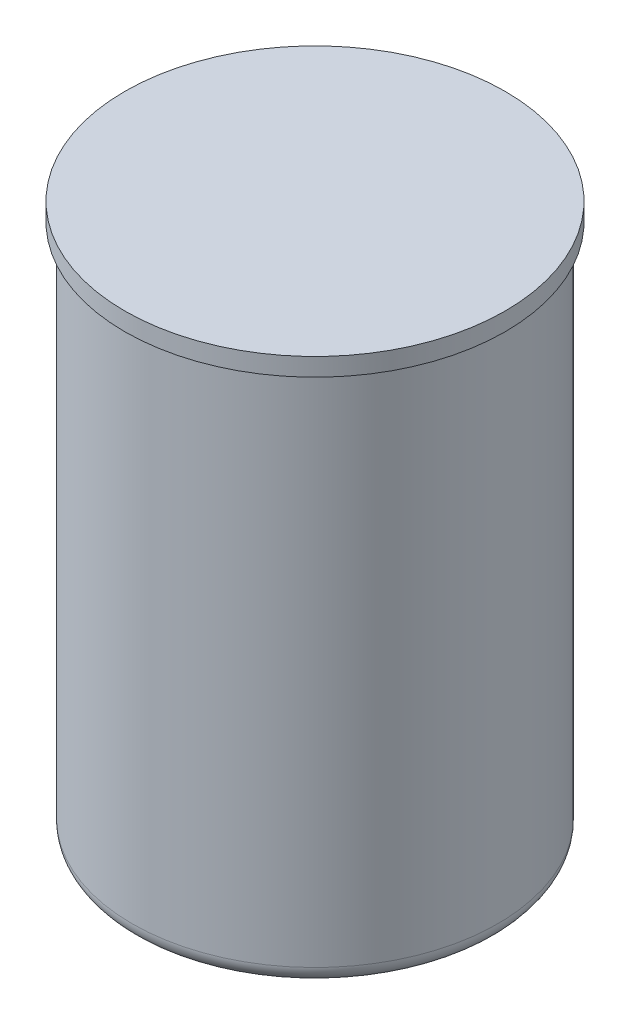
ISO-10303-21;
HEADER;
FILE_DESCRIPTION(('STEP AP214'),'2;1');
FILE_NAME('part.step','',(''),(''),'','','');
FILE_SCHEMA(('AUTOMOTIVE_DESIGN { 1 0 10303 214 1 1 1 1 }'));
ENDSEC;
DATA;
#1=APPLICATION_CONTEXT('core data for automotive mechanical design processes');
#2=APPLICATION_PROTOCOL_DEFINITION('international standard','automotive_design',2000,#1);
#3=PRODUCT_CONTEXT('',#1,'mechanical');
#4=PRODUCT('Part','Part','',(#3));
#5=PRODUCT_RELATED_PRODUCT_CATEGORY('part','',(#4));
#6=PRODUCT_DEFINITION_FORMATION('','',#4);
#7=PRODUCT_DEFINITION_CONTEXT('part definition',#1,'design');
#8=PRODUCT_DEFINITION('design','',#6,#7);
#9=PRODUCT_DEFINITION_SHAPE('','',#8);
#10=(LENGTH_UNIT() NAMED_UNIT(*) SI_UNIT(.MILLI.,.METRE.));
#11=(NAMED_UNIT(*) PLANE_ANGLE_UNIT() SI_UNIT($,.RADIAN.));
#12=(NAMED_UNIT(*) SI_UNIT($,.STERADIAN.) SOLID_ANGLE_UNIT());
#13=UNCERTAINTY_MEASURE_WITH_UNIT(LENGTH_MEASURE(1.E-05),#10,'distance_accuracy_value','');
#14=(GEOMETRIC_REPRESENTATION_CONTEXT(3) GLOBAL_UNCERTAINTY_ASSIGNED_CONTEXT((#13)) GLOBAL_UNIT_ASSIGNED_CONTEXT((#10,
#11,#12)) REPRESENTATION_CONTEXT('',''));
#15=CARTESIAN_POINT('',(0.,0.,0.));
#16=DIRECTION('',(0.,0.,1.));
#17=DIRECTION('',(1.,0.,0.));
#18=AXIS2_PLACEMENT_3D('',#15,#16,#17);
#19=CARTESIAN_POINT('',(0.,150.,0.));
#20=DIRECTION('',(0.,-1.,0.));
#21=DIRECTION('',(0.,0.,-1.));
#22=AXIS2_PLACEMENT_3D('',#19,#20,#21);
#23=CYLINDRICAL_SURFACE('',#22,50.8900947095449);
#24=CARTESIAN_POINT('',(0.,3.717971644845,0.));
#25=DIRECTION('',(0.,-1.,0.));
#26=DIRECTION('',(0.,0.,-1.));
#27=AXIS2_PLACEMENT_3D('',#24,#25,#26);
#28=CIRCLE('',#27,50.8900947095449);
#29=CARTESIAN_POINT('',(0.,3.717971644845,-50.8900947095449));
#30=VERTEX_POINT('',#29);
#31=EDGE_CURVE('E251',#30,#30,#28,.F.);
#32=ORIENTED_EDGE('',*,*,#31,.T.);
#33=EDGE_LOOP('',(#32));
#34=FACE_BOUND('',#33,.T.);
#35=CARTESIAN_POINT('',(0.,147.5,0.));
#36=DIRECTION('',(0.,1.,0.));
#37=DIRECTION('',(0.,0.,1.));
#38=AXIS2_PLACEMENT_3D('',#35,#36,#37);
#39=CIRCLE('',#38,50.8900947095449);
#40=CARTESIAN_POINT('',(0.,147.5,50.8900947095449));
#41=VERTEX_POINT('',#40);
#42=EDGE_CURVE('E262',#41,#41,#39,.T.);
#43=ORIENTED_EDGE('',*,*,#42,.F.);
#44=EDGE_LOOP('',(#43));
#45=FACE_BOUND('',#44,.T.);
#46=ADVANCED_FACE('F48',(#34,#45),#23,.T.);
#47=CARTESIAN_POINT('',(0.,0.,0.));
#48=DIRECTION('',(0.,1.,0.));
#49=DIRECTION('',(0.,0.,1.));
#50=AXIS2_PLACEMENT_3D('',#47,#48,#49);
#51=CYLINDRICAL_SURFACE('',#50,17.5714106184439);
#52=CARTESIAN_POINT('',(0.,0.,0.));
#53=DIRECTION('',(0.,1.,0.));
#54=DIRECTION('',(0.,0.,1.));
#55=AXIS2_PLACEMENT_3D('',#52,#53,#54);
#56=CIRCLE('',#55,17.5714106184439);
#57=CARTESIAN_POINT('',(0.,0.,17.5714106184439));
#58=VERTEX_POINT('',#57);
#59=EDGE_CURVE('E233',#58,#58,#56,.T.);
#60=ORIENTED_EDGE('',*,*,#59,.F.);
#61=EDGE_LOOP('',(#60));
#62=FACE_BOUND('',#61,.T.);
#63=CARTESIAN_POINT('',(0.,142.5,0.));
#64=DIRECTION('',(0.,1.,0.));
#65=DIRECTION('',(0.,0.,1.));
#66=AXIS2_PLACEMENT_3D('',#63,#64,#65);
#67=CIRCLE('',#66,17.5714106184439);
#68=CARTESIAN_POINT('',(0.,142.5,17.5714106184439));
#69=VERTEX_POINT('',#68);
#70=CARTESIAN_POINT('',(0.,142.5,-17.5714106184439));
#71=VERTEX_POINT('',#70);
#72=EDGE_CURVE('E175',#69,#71,#67,.F.);
#73=ORIENTED_EDGE('',*,*,#72,.F.);
#74=DIRECTION('',(0.,1.,0.));
#75=VECTOR('',#74,1.);
#76=CARTESIAN_POINT('',(0.,2.5,17.5714106184439));
#77=LINE('',#76,#75);
#78=CARTESIAN_POINT('',(0.,2.5,17.5714106184439));
#79=VERTEX_POINT('',#78);
#80=EDGE_CURVE('E193',#79,#69,#77,.T.);
#81=ORIENTED_EDGE('',*,*,#80,.F.);
#82=CARTESIAN_POINT('',(0.,2.5,0.));
#83=DIRECTION('',(0.,-1.,0.));
#84=DIRECTION('',(0.,0.,-1.));
#85=AXIS2_PLACEMENT_3D('',#82,#83,#84);
#86=CIRCLE('',#85,17.5714106184439);
#87=CARTESIAN_POINT('',(2.81398906962431,2.5,17.344622700941));
#88=VERTEX_POINT('',#87);
#89=EDGE_CURVE('E249',#79,#88,#86,.F.);
#90=ORIENTED_EDGE('',*,*,#89,.T.);
#91=DIRECTION('',(0.,1.,0.));
#92=VECTOR('',#91,1.);
#93=CARTESIAN_POINT('',(2.81398906962431,0.,17.344622700941));
#94=LINE('',#93,#92);
#95=CARTESIAN_POINT('',(2.81398906962431,142.5,17.344622700941));
#96=VERTEX_POINT('',#95);
#97=EDGE_CURVE('E246',#88,#96,#94,.T.);
#98=ORIENTED_EDGE('',*,*,#97,.T.);
#99=CARTESIAN_POINT('',(2.81398906962431,142.5,-17.344622700941));
#100=VERTEX_POINT('',#99);
#101=EDGE_CURVE('E173',#100,#96,#67,.F.);
#102=ORIENTED_EDGE('',*,*,#101,.F.);
#103=DIRECTION('',(0.,1.,0.));
#104=VECTOR('',#103,1.);
#105=CARTESIAN_POINT('',(2.81398906962431,0.,-17.344622700941));
#106=LINE('',#105,#104);
#107=CARTESIAN_POINT('',(2.81398906962431,2.5,-17.344622700941));
#108=VERTEX_POINT('',#107);
#109=EDGE_CURVE('E241',#100,#108,#106,.F.);
#110=ORIENTED_EDGE('',*,*,#109,.T.);
#111=CARTESIAN_POINT('',(0.,2.5,0.));
#112=DIRECTION('',(0.,1.,0.));
#113=DIRECTION('',(0.,0.,1.));
#114=AXIS2_PLACEMENT_3D('',#111,#112,#113);
#115=CIRCLE('',#114,17.5714106184439);
#116=CARTESIAN_POINT('',(0.,2.5,-17.5714106184439));
#117=VERTEX_POINT('',#116);
#118=EDGE_CURVE('E243',#117,#108,#115,.F.);
#119=ORIENTED_EDGE('',*,*,#118,.F.);
#120=DIRECTION('',(0.,1.,0.));
#121=VECTOR('',#120,1.);
#122=CARTESIAN_POINT('',(0.,2.5,-17.5714106184439));
#123=LINE('',#122,#121);
#124=EDGE_CURVE('E212',#117,#71,#123,.T.);
#125=ORIENTED_EDGE('',*,*,#124,.T.);
#126=EDGE_LOOP('',(#73,#81,#90,#98,#102,#110,#119,#125));
#127=FACE_BOUND('',#126,.T.);
#128=ADVANCED_FACE('F289',(#62,#127),#51,.F.);
#129=CARTESIAN_POINT('',(2.81398906962431,2.5,-17.5714106184439));
#130=DIRECTION('',(1.,0.,0.));
#131=DIRECTION('',(0.,0.,-1.));
#132=AXIS2_PLACEMENT_3D('',#129,#130,#131);
#133=PLANE('',#132);
#134=ORIENTED_EDGE('',*,*,#109,.F.);
#135=DIRECTION('',(0.,0.,1.));
#136=VECTOR('',#135,1.);
#137=CARTESIAN_POINT('',(2.81398906962431,142.5,-17.5714106184439));
#138=LINE('',#137,#136);
#139=CARTESIAN_POINT('',(2.81398906962431,142.5,-11.9952929361759));
#140=VERTEX_POINT('',#139);
#141=EDGE_CURVE('E179',#100,#140,#138,.T.);
#142=ORIENTED_EDGE('',*,*,#141,.T.);
#143=DIRECTION('',(0.,1.,0.));
#144=VECTOR('',#143,1.);
#145=CARTESIAN_POINT('',(2.81398906962431,2.5,-11.9952929361759));
#146=LINE('',#145,#144);
#147=CARTESIAN_POINT('',(2.81398906962431,2.5,-11.9952929361759));
#148=VERTEX_POINT('',#147);
#149=EDGE_CURVE('E216',#148,#140,#146,.T.);
#150=ORIENTED_EDGE('',*,*,#149,.F.);
#151=DIRECTION('',(0.,0.,-1.));
#152=VECTOR('',#151,1.);
#153=CARTESIAN_POINT('',(2.81398906962431,2.5,-17.5714106184439));
#154=LINE('',#153,#152);
#155=EDGE_CURVE('E208',#148,#108,#154,.T.);
#156=ORIENTED_EDGE('',*,*,#155,.T.);
#157=EDGE_LOOP('',(#134,#142,#150,#156));
#158=FACE_BOUND('',#157,.T.);
#159=ADVANCED_FACE('F295',(#158),#133,.T.);
#160=CARTESIAN_POINT('',(0.,2.5,-17.5714106184439));
#161=DIRECTION('',(-1.,0.,0.));
#162=DIRECTION('',(0.,0.,1.));
#163=AXIS2_PLACEMENT_3D('',#160,#161,#162);
#164=PLANE('',#163);
#165=DIRECTION('',(0.,1.,0.));
#166=VECTOR('',#165,1.);
#167=CARTESIAN_POINT('',(0.,2.5,-11.9952929361759));
#168=LINE('',#167,#166);
#169=CARTESIAN_POINT('',(0.,2.5,-11.9952929361759));
#170=VERTEX_POINT('',#169);
#171=CARTESIAN_POINT('',(0.,142.5,-11.9952929361759));
#172=VERTEX_POINT('',#171);
#173=EDGE_CURVE('E211',#170,#172,#168,.T.);
#174=ORIENTED_EDGE('',*,*,#173,.T.);
#175=DIRECTION('',(0.,0.,-1.));
#176=VECTOR('',#175,1.);
#177=CARTESIAN_POINT('',(0.,142.5,-17.5714106184439));
#178=LINE('',#177,#176);
#179=EDGE_CURVE('E176',#172,#71,#178,.T.);
#180=ORIENTED_EDGE('',*,*,#179,.T.);
#181=ORIENTED_EDGE('',*,*,#124,.F.);
#182=DIRECTION('',(0.,0.,1.));
#183=VECTOR('',#182,1.);
#184=CARTESIAN_POINT('',(0.,2.5,-17.5714106184439));
#185=LINE('',#184,#183);
#186=EDGE_CURVE('E197',#117,#170,#185,.T.);
#187=ORIENTED_EDGE('',*,*,#186,.T.);
#188=EDGE_LOOP('',(#174,#180,#181,#187));
#189=FACE_BOUND('',#188,.T.);
#190=ADVANCED_FACE('F362',(#189),#164,.T.);
#191=CARTESIAN_POINT('',(0.,2.5,-11.9952929361759));
#192=DIRECTION('',(0.,0.,1.));
#193=DIRECTION('',(1.,0.,0.));
#194=AXIS2_PLACEMENT_3D('',#191,#192,#193);
#195=PLANE('',#194);
#196=ORIENTED_EDGE('',*,*,#149,.T.);
#197=DIRECTION('',(-1.,0.,0.));
#198=VECTOR('',#197,1.);
#199=CARTESIAN_POINT('',(0.,142.5,-11.9952929361759));
#200=LINE('',#199,#198);
#201=EDGE_CURVE('E182',#140,#172,#200,.T.);
#202=ORIENTED_EDGE('',*,*,#201,.T.);
#203=ORIENTED_EDGE('',*,*,#173,.F.);
#204=DIRECTION('',(1.,0.,0.));
#205=VECTOR('',#204,1.);
#206=CARTESIAN_POINT('',(0.,2.5,-11.9952929361759));
#207=LINE('',#206,#205);
#208=EDGE_CURVE('E205',#170,#148,#207,.T.);
#209=ORIENTED_EDGE('',*,*,#208,.T.);
#210=EDGE_LOOP('',(#196,#202,#203,#209));
#211=FACE_BOUND('',#210,.T.);
#212=ADVANCED_FACE('F360',(#211),#195,.T.);
#213=CARTESIAN_POINT('',(2.81398906962431,2.5,17.5714106184439));
#214=DIRECTION('',(1.,0.,0.));
#215=DIRECTION('',(0.,0.,-1.));
#216=AXIS2_PLACEMENT_3D('',#213,#214,#215);
#217=PLANE('',#216);
#218=DIRECTION('',(0.,1.,0.));
#219=VECTOR('',#218,1.);
#220=CARTESIAN_POINT('',(2.81398906962431,2.5,11.9952929361759));
#221=LINE('',#220,#219);
#222=CARTESIAN_POINT('',(2.81398906962431,2.5,11.9952929361759));
#223=VERTEX_POINT('',#222);
#224=CARTESIAN_POINT('',(2.81398906962431,142.5,11.9952929361759));
#225=VERTEX_POINT('',#224);
#226=EDGE_CURVE('E198',#223,#225,#221,.T.);
#227=ORIENTED_EDGE('',*,*,#226,.T.);
#228=DIRECTION('',(0.,0.,1.));
#229=VECTOR('',#228,1.);
#230=CARTESIAN_POINT('',(2.81398906962431,142.5,17.5714106184439));
#231=LINE('',#230,#229);
#232=EDGE_CURVE('E71',#225,#96,#231,.T.);
#233=ORIENTED_EDGE('',*,*,#232,.T.);
#234=ORIENTED_EDGE('',*,*,#97,.F.);
#235=DIRECTION('',(0.,0.,-1.));
#236=VECTOR('',#235,1.);
#237=CARTESIAN_POINT('',(2.81398906962431,2.5,17.5714106184439));
#238=LINE('',#237,#236);
#239=EDGE_CURVE('E188',#88,#223,#238,.T.);
#240=ORIENTED_EDGE('',*,*,#239,.T.);
#241=EDGE_LOOP('',(#227,#233,#234,#240));
#242=FACE_BOUND('',#241,.T.);
#243=ADVANCED_FACE('F349',(#242),#217,.T.);
#244=CARTESIAN_POINT('',(0.,2.5,17.5714106184439));
#245=DIRECTION('',(-1.,0.,0.));
#246=DIRECTION('',(0.,0.,1.));
#247=AXIS2_PLACEMENT_3D('',#244,#245,#246);
#248=PLANE('',#247);
#249=ORIENTED_EDGE('',*,*,#80,.T.);
#250=DIRECTION('',(0.,0.,-1.));
#251=VECTOR('',#250,1.);
#252=CARTESIAN_POINT('',(0.,142.5,17.5714106184439));
#253=LINE('',#252,#251);
#254=CARTESIAN_POINT('',(0.,142.5,11.9952929361759));
#255=VERTEX_POINT('',#254);
#256=EDGE_CURVE('E168',#69,#255,#253,.T.);
#257=ORIENTED_EDGE('',*,*,#256,.T.);
#258=DIRECTION('',(0.,1.,0.));
#259=VECTOR('',#258,1.);
#260=CARTESIAN_POINT('',(0.,2.5,11.9952929361759));
#261=LINE('',#260,#259);
#262=CARTESIAN_POINT('',(0.,2.5,11.9952929361759));
#263=VERTEX_POINT('',#262);
#264=EDGE_CURVE('E194',#263,#255,#261,.T.);
#265=ORIENTED_EDGE('',*,*,#264,.F.);
#266=DIRECTION('',(0.,0.,1.));
#267=VECTOR('',#266,1.);
#268=CARTESIAN_POINT('',(0.,2.5,17.5714106184439));
#269=LINE('',#268,#267);
#270=EDGE_CURVE('E185',#263,#79,#269,.T.);
#271=ORIENTED_EDGE('',*,*,#270,.T.);
#272=EDGE_LOOP('',(#249,#257,#265,#271));
#273=FACE_BOUND('',#272,.T.);
#274=ADVANCED_FACE('F334',(#273),#248,.T.);
#275=CARTESIAN_POINT('',(0.,2.5,11.9952929361759));
#276=DIRECTION('',(0.,0.,-1.));
#277=DIRECTION('',(-1.,0.,0.));
#278=AXIS2_PLACEMENT_3D('',#275,#276,#277);
#279=PLANE('',#278);
#280=ORIENTED_EDGE('',*,*,#264,.T.);
#281=DIRECTION('',(1.,0.,0.));
#282=VECTOR('',#281,1.);
#283=CARTESIAN_POINT('',(0.,142.5,11.9952929361759));
#284=LINE('',#283,#282);
#285=EDGE_CURVE('E260',#255,#225,#284,.T.);
#286=ORIENTED_EDGE('',*,*,#285,.T.);
#287=ORIENTED_EDGE('',*,*,#226,.F.);
#288=DIRECTION('',(-1.,0.,0.));
#289=VECTOR('',#288,1.);
#290=CARTESIAN_POINT('',(0.,2.5,11.9952929361759));
#291=LINE('',#290,#289);
#292=EDGE_CURVE('E190',#223,#263,#291,.T.);
#293=ORIENTED_EDGE('',*,*,#292,.T.);
#294=EDGE_LOOP('',(#280,#286,#287,#293));
#295=FACE_BOUND('',#294,.T.);
#296=ADVANCED_FACE('F326',(#295),#279,.T.);
#297=CARTESIAN_POINT('',(0.,0.,0.));
#298=DIRECTION('',(0.,1.,0.));
#299=DIRECTION('',(0.,0.,1.));
#300=AXIS2_PLACEMENT_3D('',#297,#298,#299);
#301=PLANE('',#300);
#302=ORIENTED_EDGE('',*,*,#59,.T.);
#303=EDGE_LOOP('',(#302));
#304=FACE_BOUND('',#303,.T.);
#305=CARTESIAN_POINT('',(0.,0.,0.));
#306=DIRECTION('',(0.,-1.,0.));
#307=DIRECTION('',(0.,0.,-1.));
#308=AXIS2_PLACEMENT_3D('',#305,#306,#307);
#309=CIRCLE('',#308,17.829813715774);
#310=CARTESIAN_POINT('',(0.,0.,-17.829813715774));
#311=VERTEX_POINT('',#310);
#312=EDGE_CURVE('E227',#311,#311,#309,.T.);
#313=ORIENTED_EDGE('',*,*,#312,.T.);
#314=EDGE_LOOP('',(#313));
#315=FACE_BOUND('',#314,.T.);
#316=ADVANCED_FACE('F301',(#304,#315),#301,.F.);
#317=CARTESIAN_POINT('',(0.,-15.,0.));
#318=DIRECTION('',(0.,1.,0.));
#319=DIRECTION('',(0.,0.,1.));
#320=AXIS2_PLACEMENT_3D('',#317,#318,#319);
#321=CYLINDRICAL_SURFACE('',#320,19.4768924120961);
#322=CARTESIAN_POINT('',(0.,-11.2908331486245,0.));
#323=DIRECTION('',(0.,-1.,0.));
#324=DIRECTION('',(0.,0.,-1.));
#325=AXIS2_PLACEMENT_3D('',#322,#323,#324);
#326=CIRCLE('',#325,19.4768924120961);
#327=CARTESIAN_POINT('',(0.,-11.2908331486245,-19.4768924120961));
#328=VERTEX_POINT('',#327);
#329=EDGE_CURVE('E254',#328,#328,#326,.F.);
#330=ORIENTED_EDGE('',*,*,#329,.T.);
#331=EDGE_LOOP('',(#330));
#332=FACE_BOUND('',#331,.T.);
#333=CARTESIAN_POINT('',(0.,0.,0.));
#334=DIRECTION('',(0.,1.,0.));
#335=DIRECTION('',(0.,0.,1.));
#336=AXIS2_PLACEMENT_3D('',#333,#334,#335);
#337=CIRCLE('',#336,19.4768924120961);
#338=CARTESIAN_POINT('',(0.,0.,19.4768924120961));
#339=VERTEX_POINT('',#338);
#340=EDGE_CURVE('E238',#339,#339,#337,.F.);
#341=ORIENTED_EDGE('',*,*,#340,.T.);
#342=EDGE_LOOP('',(#341));
#343=FACE_BOUND('',#342,.T.);
#344=ADVANCED_FACE('F321',(#332,#343),#321,.T.);
#345=CARTESIAN_POINT('',(0.,-15.,0.));
#346=DIRECTION('',(0.,1.,0.));
#347=DIRECTION('',(0.,0.,1.));
#348=AXIS2_PLACEMENT_3D('',#345,#346,#347);
#349=CYLINDRICAL_SURFACE('',#348,17.829813715774);
#350=CARTESIAN_POINT('',(0.,-15.,0.));
#351=DIRECTION('',(0.,-1.,0.));
#352=DIRECTION('',(0.,0.,-1.));
#353=AXIS2_PLACEMENT_3D('',#350,#351,#352);
#354=CIRCLE('',#353,17.829813715774);
#355=CARTESIAN_POINT('',(0.,-15.,-17.829813715774));
#356=VERTEX_POINT('',#355);
#357=EDGE_CURVE('E230',#356,#356,#354,.T.);
#358=ORIENTED_EDGE('',*,*,#357,.T.);
#359=EDGE_LOOP('',(#358));
#360=FACE_BOUND('',#359,.T.);
#361=ORIENTED_EDGE('',*,*,#312,.F.);
#362=EDGE_LOOP('',(#361));
#363=FACE_BOUND('',#362,.T.);
#364=ADVANCED_FACE('F317',(#360,#363),#349,.F.);
#365=CARTESIAN_POINT('',(0.,5.,0.));
#366=DIRECTION('',(0.,-1.,0.));
#367=DIRECTION('',(0.,0.,-1.));
#368=AXIS2_PLACEMENT_3D('',#365,#366,#367);
#369=CYLINDRICAL_SURFACE('',#368,49.233249933002);
#370=CARTESIAN_POINT('',(0.,5.,0.));
#371=DIRECTION('',(0.,-1.,0.));
#372=DIRECTION('',(0.,0.,-1.));
#373=AXIS2_PLACEMENT_3D('',#370,#371,#372);
#374=CIRCLE('',#373,49.233249933002);
#375=CARTESIAN_POINT('',(0.,5.,-49.233249933002));
#376=VERTEX_POINT('',#375);
#377=EDGE_CURVE('E224',#376,#376,#374,.T.);
#378=ORIENTED_EDGE('',*,*,#377,.F.);
#379=EDGE_LOOP('',(#378));
#380=FACE_BOUND('',#379,.T.);
#381=CARTESIAN_POINT('',(0.,0.,0.));
#382=DIRECTION('',(0.,-1.,0.));
#383=DIRECTION('',(0.,0.,-1.));
#384=AXIS2_PLACEMENT_3D('',#381,#382,#383);
#385=CIRCLE('',#384,49.233249933002);
#386=CARTESIAN_POINT('',(0.,0.,-49.233249933002));
#387=VERTEX_POINT('',#386);
#388=EDGE_CURVE('E223',#387,#387,#385,.T.);
#389=ORIENTED_EDGE('',*,*,#388,.T.);
#390=EDGE_LOOP('',(#389));
#391=FACE_BOUND('',#390,.T.);
#392=ADVANCED_FACE('F320',(#380,#391),#369,.F.);
#393=CARTESIAN_POINT('',(0.,5.,0.));
#394=DIRECTION('',(0.,-1.,0.));
#395=DIRECTION('',(0.,0.,-1.));
#396=AXIS2_PLACEMENT_3D('',#393,#394,#395);
#397=PLANE('',#396);
#398=CARTESIAN_POINT('',(0.,5.,0.));
#399=DIRECTION('',(0.,-1.,0.));
#400=DIRECTION('',(0.,0.,-1.));
#401=AXIS2_PLACEMENT_3D('',#398,#399,#400);
#402=CIRCLE('',#401,21.5317394756691);
#403=CARTESIAN_POINT('',(0.,5.,-21.5317394756691));
#404=VERTEX_POINT('',#403);
#405=EDGE_CURVE('E215',#404,#404,#402,.T.);
#406=ORIENTED_EDGE('',*,*,#405,.F.);
#407=EDGE_LOOP('',(#406));
#408=FACE_BOUND('',#407,.T.);
#409=ORIENTED_EDGE('',*,*,#377,.T.);
#410=EDGE_LOOP('',(#409));
#411=FACE_BOUND('',#410,.T.);
#412=ADVANCED_FACE('F395',(#408,#411),#397,.T.);
#413=CARTESIAN_POINT('',(0.,5.,0.));
#414=DIRECTION('',(0.,-1.,0.));
#415=DIRECTION('',(0.,0.,-1.));
#416=AXIS2_PLACEMENT_3D('',#413,#414,#415);
#417=CYLINDRICAL_SURFACE('',#416,21.5317394756691);
#418=CARTESIAN_POINT('',(0.,4.04055369733593,0.));
#419=DIRECTION('',(0.,-1.,0.));
#420=DIRECTION('',(0.,0.,-1.));
#421=AXIS2_PLACEMENT_3D('',#418,#419,#420);
#422=CIRCLE('',#421,21.5317394756691);
#423=CARTESIAN_POINT('',(0.,4.04055369733593,-21.5317394756691));
#424=VERTEX_POINT('',#423);
#425=EDGE_CURVE('E257',#424,#424,#422,.F.);
#426=ORIENTED_EDGE('',*,*,#425,.T.);
#427=EDGE_LOOP('',(#426));
#428=FACE_BOUND('',#427,.T.);
#429=ORIENTED_EDGE('',*,*,#405,.T.);
#430=EDGE_LOOP('',(#429));
#431=FACE_BOUND('',#430,.T.);
#432=ADVANCED_FACE('F386',(#428,#431),#417,.T.);
#433=CARTESIAN_POINT('',(0.,2.5,0.));
#434=DIRECTION('',(0.,1.,0.));
#435=DIRECTION('',(0.,0.,1.));
#436=AXIS2_PLACEMENT_3D('',#433,#434,#435);
#437=PLANE('',#436);
#438=ORIENTED_EDGE('',*,*,#186,.F.);
#439=ORIENTED_EDGE('',*,*,#118,.T.);
#440=ORIENTED_EDGE('',*,*,#155,.F.);
#441=ORIENTED_EDGE('',*,*,#208,.F.);
#442=EDGE_LOOP('',(#438,#439,#440,#441));
#443=FACE_BOUND('',#442,.T.);
#444=ADVANCED_FACE('F358',(#443),#437,.F.);
#445=CARTESIAN_POINT('',(0.,2.5,0.));
#446=DIRECTION('',(0.,-1.,0.));
#447=DIRECTION('',(0.,0.,-1.));
#448=AXIS2_PLACEMENT_3D('',#445,#446,#447);
#449=PLANE('',#448);
#450=ORIENTED_EDGE('',*,*,#89,.F.);
#451=ORIENTED_EDGE('',*,*,#270,.F.);
#452=ORIENTED_EDGE('',*,*,#292,.F.);
#453=ORIENTED_EDGE('',*,*,#239,.F.);
#454=EDGE_LOOP('',(#450,#451,#452,#453));
#455=FACE_BOUND('',#454,.T.);
#456=ADVANCED_FACE('F305',(#455),#449,.T.);
#457=CARTESIAN_POINT('',(0.,3.717971644845,0.));
#458=DIRECTION('',(0.,-1.,0.));
#459=DIRECTION('',(0.,0.,-1.));
#460=AXIS2_PLACEMENT_3D('',#457,#458,#459);
#461=TOROIDAL_SURFACE('',#460,45.8900947095449,5.);
#462=ORIENTED_EDGE('',*,*,#388,.F.);
#463=EDGE_LOOP('',(#462));
#464=FACE_BOUND('',#463,.T.);
#465=ORIENTED_EDGE('',*,*,#31,.F.);
#466=EDGE_LOOP('',(#465));
#467=FACE_BOUND('',#466,.T.);
#468=ADVANCED_FACE('F302',(#464,#467),#461,.T.);
#469=CARTESIAN_POINT('',(0.,-11.2908331486245,0.));
#470=DIRECTION('',(0.,-1.,0.));
#471=DIRECTION('',(0.,0.,-1.));
#472=AXIS2_PLACEMENT_3D('',#469,#470,#471);
#473=TOROIDAL_SURFACE('',#472,14.4768924120961,5.);
#474=ORIENTED_EDGE('',*,*,#329,.F.);
#475=EDGE_LOOP('',(#474));
#476=FACE_BOUND('',#475,.T.);
#477=ORIENTED_EDGE('',*,*,#357,.F.);
#478=EDGE_LOOP('',(#477));
#479=FACE_BOUND('',#478,.T.);
#480=ADVANCED_FACE('F304',(#476,#479),#473,.T.);
#481=CARTESIAN_POINT('',(0.,4.04055369733593,0.));
#482=DIRECTION('',(0.,-1.,0.));
#483=DIRECTION('',(0.,0.,-1.));
#484=AXIS2_PLACEMENT_3D('',#481,#482,#483);
#485=TOROIDAL_SURFACE('',#484,16.5317394756691,5.);
#486=ORIENTED_EDGE('',*,*,#425,.F.);
#487=EDGE_LOOP('',(#486));
#488=FACE_BOUND('',#487,.T.);
#489=ORIENTED_EDGE('',*,*,#340,.F.);
#490=EDGE_LOOP('',(#489));
#491=FACE_BOUND('',#490,.T.);
#492=ADVANCED_FACE('F50',(#488,#491),#485,.T.);
#493=CARTESIAN_POINT('',(0.,142.5,0.));
#494=DIRECTION('',(0.,1.,0.));
#495=DIRECTION('',(0.,0.,1.));
#496=AXIS2_PLACEMENT_3D('',#493,#494,#495);
#497=PLANE('',#496);
#498=DIRECTION('',(0.,0.,-1.));
#499=VECTOR('',#498,1.);
#500=CARTESIAN_POINT('',(-2.96993063834447,142.5,0.));
#501=LINE('',#500,#499);
#502=CARTESIAN_POINT('',(-2.96993063834447,142.5,10.));
#503=VERTEX_POINT('',#502);
#504=CARTESIAN_POINT('',(-2.96993063834447,142.5,0.));
#505=VERTEX_POINT('',#504);
#506=EDGE_CURVE('E267',#503,#505,#501,.T.);
#507=ORIENTED_EDGE('',*,*,#506,.F.);
#508=DIRECTION('',(1.,0.,0.));
#509=VECTOR('',#508,1.);
#510=CARTESIAN_POINT('',(0.,142.5,10.));
#511=LINE('',#510,#509);
#512=CARTESIAN_POINT('',(2.96993063834449,142.5,10.));
#513=VERTEX_POINT('',#512);
#514=EDGE_CURVE('E13',#503,#513,#511,.T.);
#515=ORIENTED_EDGE('',*,*,#514,.T.);
#516=DIRECTION('',(0.,0.,1.));
#517=VECTOR('',#516,1.);
#518=CARTESIAN_POINT('',(2.96993063834449,142.5,0.));
#519=LINE('',#518,#517);
#520=CARTESIAN_POINT('',(2.96993063834449,142.5,0.));
#521=VERTEX_POINT('',#520);
#522=EDGE_CURVE('E56',#521,#513,#519,.T.);
#523=ORIENTED_EDGE('',*,*,#522,.F.);
#524=DIRECTION('',(1.,0.,0.));
#525=VECTOR('',#524,1.);
#526=CARTESIAN_POINT('',(0.,142.5,0.));
#527=LINE('',#526,#525);
#528=EDGE_CURVE('E265',#505,#521,#527,.T.);
#529=ORIENTED_EDGE('',*,*,#528,.F.);
#530=EDGE_LOOP('',(#507,#515,#523,#529));
#531=FACE_BOUND('',#530,.T.);
#532=ORIENTED_EDGE('',*,*,#201,.F.);
#533=ORIENTED_EDGE('',*,*,#141,.F.);
#534=ORIENTED_EDGE('',*,*,#101,.T.);
#535=ORIENTED_EDGE('',*,*,#232,.F.);
#536=ORIENTED_EDGE('',*,*,#285,.F.);
#537=ORIENTED_EDGE('',*,*,#256,.F.);
#538=ORIENTED_EDGE('',*,*,#72,.T.);
#539=ORIENTED_EDGE('',*,*,#179,.F.);
#540=EDGE_LOOP('',(#532,#533,#534,#535,#536,#537,#538,#539));
#541=FACE_BOUND('',#540,.T.);
#542=ADVANCED_FACE('F273',(#531,#541),#497,.F.);
#543=CARTESIAN_POINT('',(0.,147.5,0.));
#544=DIRECTION('',(0.,1.,0.));
#545=DIRECTION('',(0.,0.,1.));
#546=AXIS2_PLACEMENT_3D('',#543,#544,#545);
#547=CYLINDRICAL_SURFACE('',#546,52.9568415207158);
#548=CARTESIAN_POINT('',(0.,147.5,0.));
#549=DIRECTION('',(0.,1.,0.));
#550=DIRECTION('',(0.,0.,1.));
#551=AXIS2_PLACEMENT_3D('',#548,#549,#550);
#552=CIRCLE('',#551,52.9568415207158);
#553=CARTESIAN_POINT('',(0.,147.5,52.9568415207158));
#554=VERTEX_POINT('',#553);
#555=EDGE_CURVE('E162',#554,#554,#552,.T.);
#556=ORIENTED_EDGE('',*,*,#555,.T.);
#557=EDGE_LOOP('',(#556));
#558=FACE_BOUND('',#557,.T.);
#559=CARTESIAN_POINT('',(0.,152.5,0.));
#560=DIRECTION('',(0.,1.,0.));
#561=DIRECTION('',(0.,0.,1.));
#562=AXIS2_PLACEMENT_3D('',#559,#560,#561);
#563=CIRCLE('',#562,52.9568415207158);
#564=CARTESIAN_POINT('',(0.,152.5,52.9568415207158));
#565=VERTEX_POINT('',#564);
#566=EDGE_CURVE('E158',#565,#565,#563,.T.);
#567=ORIENTED_EDGE('',*,*,#566,.F.);
#568=EDGE_LOOP('',(#567));
#569=FACE_BOUND('',#568,.T.);
#570=ADVANCED_FACE('F364',(#558,#569),#547,.T.);
#571=CARTESIAN_POINT('',(0.,147.5,0.));
#572=DIRECTION('',(0.,1.,0.));
#573=DIRECTION('',(0.,0.,1.));
#574=AXIS2_PLACEMENT_3D('',#571,#572,#573);
#575=PLANE('',#574);
#576=ORIENTED_EDGE('',*,*,#42,.T.);
#577=EDGE_LOOP('',(#576));
#578=FACE_BOUND('',#577,.T.);
#579=ORIENTED_EDGE('',*,*,#555,.F.);
#580=EDGE_LOOP('',(#579));
#581=FACE_BOUND('',#580,.T.);
#582=ADVANCED_FACE('F369',(#578,#581),#575,.F.);
#583=CARTESIAN_POINT('',(0.,152.5,0.));
#584=DIRECTION('',(0.,1.,0.));
#585=DIRECTION('',(0.,0.,1.));
#586=AXIS2_PLACEMENT_3D('',#583,#584,#585);
#587=PLANE('',#586);
#588=ORIENTED_EDGE('',*,*,#566,.T.);
#589=EDGE_LOOP('',(#588));
#590=FACE_BOUND('',#589,.T.);
#591=ADVANCED_FACE('F374',(#590),#587,.T.);
#592=CARTESIAN_POINT('',(2.96993063834447,3.717971644845,10.));
#593=DIRECTION('',(-1.,0.,0.));
#594=DIRECTION('',(0.,-1.,0.));
#595=AXIS2_PLACEMENT_3D('',#592,#593,#594);
#596=PLANE('',#595);
#597=ORIENTED_EDGE('',*,*,#522,.T.);
#598=DIRECTION('',(0.,1.,0.));
#599=VECTOR('',#598,1.);
#600=CARTESIAN_POINT('',(2.96993063834447,3.717971644845,10.));
#601=LINE('',#600,#599);
#602=CARTESIAN_POINT('',(2.96993063834449,147.5,10.));
#603=VERTEX_POINT('',#602);
#604=EDGE_CURVE('E137',#513,#603,#601,.T.);
#605=ORIENTED_EDGE('',*,*,#604,.T.);
#606=DIRECTION('',(0.,0.,-1.));
#607=VECTOR('',#606,1.);
#608=CARTESIAN_POINT('',(2.96993063834449,147.5,10.));
#609=LINE('',#608,#607);
#610=CARTESIAN_POINT('',(2.96993063834449,147.5,0.));
#611=VERTEX_POINT('',#610);
#612=EDGE_CURVE('E142',#603,#611,#609,.T.);
#613=ORIENTED_EDGE('',*,*,#612,.T.);
#614=DIRECTION('',(0.,1.,0.));
#615=VECTOR('',#614,1.);
#616=CARTESIAN_POINT('',(2.96993063834447,3.717971644845,0.));
#617=LINE('',#616,#615);
#618=EDGE_CURVE('E275',#521,#611,#617,.T.);
#619=ORIENTED_EDGE('',*,*,#618,.F.);
#620=EDGE_LOOP('',(#597,#605,#613,#619));
#621=FACE_BOUND('',#620,.T.);
#622=ADVANCED_FACE('F139',(#621),#596,.T.);
#623=CARTESIAN_POINT('',(-2.96993063834447,147.5,10.));
#624=DIRECTION('',(1.,0.,0.));
#625=DIRECTION('',(0.,0.,-1.));
#626=AXIS2_PLACEMENT_3D('',#623,#624,#625);
#627=PLANE('',#626);
#628=ORIENTED_EDGE('',*,*,#506,.T.);
#629=DIRECTION('',(0.,-1.,0.));
#630=VECTOR('',#629,1.);
#631=CARTESIAN_POINT('',(-2.96993063834447,147.5,0.));
#632=LINE('',#631,#630);
#633=CARTESIAN_POINT('',(-2.96993063834447,147.5,0.));
#634=VERTEX_POINT('',#633);
#635=EDGE_CURVE('E63',#634,#505,#632,.T.);
#636=ORIENTED_EDGE('',*,*,#635,.F.);
#637=DIRECTION('',(0.,0.,-1.));
#638=VECTOR('',#637,1.);
#639=CARTESIAN_POINT('',(-2.96993063834447,147.5,10.));
#640=LINE('',#639,#638);
#641=CARTESIAN_POINT('',(-2.96993063834447,147.5,10.));
#642=VERTEX_POINT('',#641);
#643=EDGE_CURVE('E159',#642,#634,#640,.T.);
#644=ORIENTED_EDGE('',*,*,#643,.F.);
#645=DIRECTION('',(0.,-1.,0.));
#646=VECTOR('',#645,1.);
#647=CARTESIAN_POINT('',(-2.96993063834447,147.5,10.));
#648=LINE('',#647,#646);
#649=EDGE_CURVE('E150',#642,#503,#648,.T.);
#650=ORIENTED_EDGE('',*,*,#649,.T.);
#651=EDGE_LOOP('',(#628,#636,#644,#650));
#652=FACE_BOUND('',#651,.T.);
#653=ADVANCED_FACE('F271',(#652),#627,.T.);
#654=CARTESIAN_POINT('',(0.,0.,10.));
#655=DIRECTION('',(0.,0.,1.));
#656=DIRECTION('',(1.,0.,0.));
#657=AXIS2_PLACEMENT_3D('',#654,#655,#656);
#658=PLANE('',#657);
#659=ORIENTED_EDGE('',*,*,#649,.F.);
#660=DIRECTION('',(-1.,0.,0.));
#661=VECTOR('',#660,1.);
#662=CARTESIAN_POINT('',(2.96993063834449,147.5,10.));
#663=LINE('',#662,#661);
#664=EDGE_CURVE('E145',#603,#642,#663,.T.);
#665=ORIENTED_EDGE('',*,*,#664,.F.);
#666=ORIENTED_EDGE('',*,*,#604,.F.);
#667=ORIENTED_EDGE('',*,*,#514,.F.);
#668=EDGE_LOOP('',(#659,#665,#666,#667));
#669=FACE_BOUND('',#668,.T.);
#670=ADVANCED_FACE('F148',(#669),#658,.F.);
#671=CARTESIAN_POINT('',(0.,0.,0.));
#672=DIRECTION('',(0.,0.,1.));
#673=DIRECTION('',(1.,0.,0.));
#674=AXIS2_PLACEMENT_3D('',#671,#672,#673);
#675=PLANE('',#674);
#676=ORIENTED_EDGE('',*,*,#528,.T.);
#677=ORIENTED_EDGE('',*,*,#618,.T.);
#678=DIRECTION('',(-1.,0.,0.));
#679=VECTOR('',#678,1.);
#680=CARTESIAN_POINT('',(2.96993063834449,147.5,0.));
#681=LINE('',#680,#679);
#682=EDGE_CURVE('E157',#611,#634,#681,.T.);
#683=ORIENTED_EDGE('',*,*,#682,.T.);
#684=ORIENTED_EDGE('',*,*,#635,.T.);
#685=EDGE_LOOP('',(#676,#677,#683,#684));
#686=FACE_BOUND('',#685,.T.);
#687=ADVANCED_FACE('F274',(#686),#675,.T.);
#688=CARTESIAN_POINT('',(2.96993063834449,147.5,10.));
#689=DIRECTION('',(0.,-1.,0.));
#690=DIRECTION('',(0.,0.,-1.));
#691=AXIS2_PLACEMENT_3D('',#688,#689,#690);
#692=PLANE('',#691);
#693=ORIENTED_EDGE('',*,*,#682,.F.);
#694=ORIENTED_EDGE('',*,*,#612,.F.);
#695=ORIENTED_EDGE('',*,*,#664,.T.);
#696=ORIENTED_EDGE('',*,*,#643,.T.);
#697=EDGE_LOOP('',(#693,#694,#695,#696));
#698=FACE_BOUND('',#697,.T.);
#699=ADVANCED_FACE('F156',(#698),#692,.T.);
#700=CLOSED_SHELL('',(#46,#128,#159,#190,#212,#243,#274,#296,#316,#344,#364,#392,#412,#432,#444,
#456,#468,#480,#492,#542,#570,#582,#591,#622,#653,#670,#687,#699));
#701=MANIFOLD_SOLID_BREP('B2',#700);
#702=ADVANCED_BREP_SHAPE_REPRESENTATION('',(#18,#701),#14);
#703=SHAPE_DEFINITION_REPRESENTATION(#9,#702);
ENDSEC;
END-ISO-10303-21;
